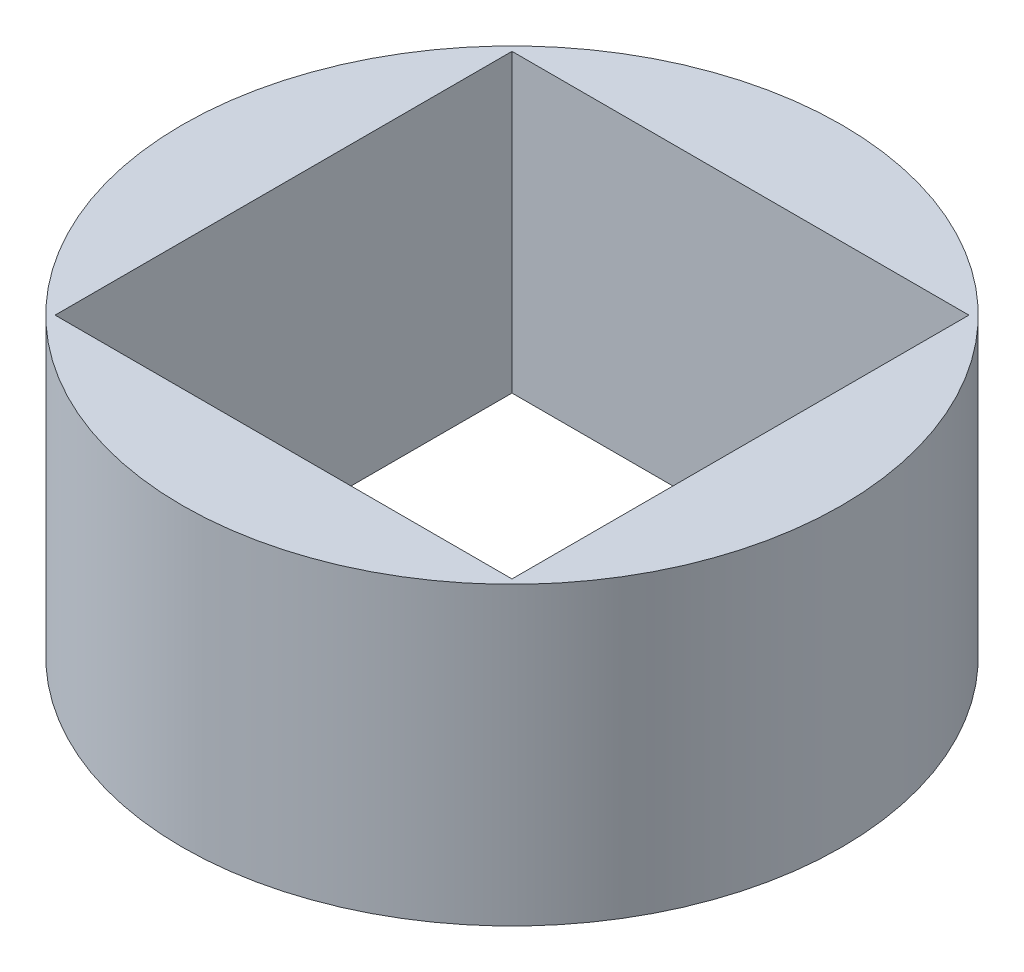
ISO-10303-21;
HEADER;
FILE_DESCRIPTION(('STEP AP214'),'2;1');
FILE_NAME('part.step','',(''),(''),'','','');
FILE_SCHEMA(('AUTOMOTIVE_DESIGN { 1 0 10303 214 1 1 1 1 }'));
ENDSEC;
DATA;
#1=APPLICATION_CONTEXT('core data for automotive mechanical design processes');
#2=APPLICATION_PROTOCOL_DEFINITION('international standard','automotive_design',2000,#1);
#3=PRODUCT_CONTEXT('',#1,'mechanical');
#4=PRODUCT('Part','Part','',(#3));
#5=PRODUCT_RELATED_PRODUCT_CATEGORY('part','',(#4));
#6=PRODUCT_DEFINITION_FORMATION('','',#4);
#7=PRODUCT_DEFINITION_CONTEXT('part definition',#1,'design');
#8=PRODUCT_DEFINITION('design','',#6,#7);
#9=PRODUCT_DEFINITION_SHAPE('','',#8);
#10=(LENGTH_UNIT() NAMED_UNIT(*) SI_UNIT(.MILLI.,.METRE.));
#11=(NAMED_UNIT(*) PLANE_ANGLE_UNIT() SI_UNIT($,.RADIAN.));
#12=(NAMED_UNIT(*) SI_UNIT($,.STERADIAN.) SOLID_ANGLE_UNIT());
#13=UNCERTAINTY_MEASURE_WITH_UNIT(LENGTH_MEASURE(1.E-05),#10,'distance_accuracy_value','');
#14=(GEOMETRIC_REPRESENTATION_CONTEXT(3) GLOBAL_UNCERTAINTY_ASSIGNED_CONTEXT((#13)) GLOBAL_UNIT_ASSIGNED_CONTEXT((#10,
#11,#12)) REPRESENTATION_CONTEXT('',''));
#15=CARTESIAN_POINT('',(0.,0.,0.));
#16=DIRECTION('',(0.,0.,1.));
#17=DIRECTION('',(1.,0.,0.));
#18=AXIS2_PLACEMENT_3D('',#15,#16,#17);
#19=CARTESIAN_POINT('',(0.,1.14,0.));
#20=DIRECTION('',(0.,-1.,0.));
#21=DIRECTION('',(0.,0.,-1.));
#22=AXIS2_PLACEMENT_3D('',#19,#20,#21);
#23=CYLINDRICAL_SURFACE('',#22,1.27);
#24=CARTESIAN_POINT('',(0.,1.14,0.));
#25=DIRECTION('',(0.,1.,0.));
#26=DIRECTION('',(0.,0.,1.));
#27=AXIS2_PLACEMENT_3D('',#24,#25,#26);
#28=CIRCLE('',#27,1.27);
#29=CARTESIAN_POINT('',(0.,1.14,1.27));
#30=VERTEX_POINT('',#29);
#31=EDGE_CURVE('E11',#30,#30,#28,.T.);
#32=ORIENTED_EDGE('',*,*,#31,.F.);
#33=EDGE_LOOP('',(#32));
#34=FACE_BOUND('',#33,.T.);
#35=CARTESIAN_POINT('',(0.,0.,0.));
#36=DIRECTION('',(0.,1.,0.));
#37=DIRECTION('',(0.,0.,1.));
#38=AXIS2_PLACEMENT_3D('',#35,#36,#37);
#39=CIRCLE('',#38,1.27);
#40=CARTESIAN_POINT('',(0.,0.,1.27));
#41=VERTEX_POINT('',#40);
#42=EDGE_CURVE('E42',#41,#41,#39,.T.);
#43=ORIENTED_EDGE('',*,*,#42,.T.);
#44=EDGE_LOOP('',(#43));
#45=FACE_BOUND('',#44,.T.);
#46=ADVANCED_FACE('F39',(#34,#45),#23,.T.);
#47=CARTESIAN_POINT('',(0.,1.14,0.));
#48=DIRECTION('',(0.,1.,0.));
#49=DIRECTION('',(0.,0.,1.));
#50=AXIS2_PLACEMENT_3D('',#47,#48,#49);
#51=PLANE('',#50);
#52=DIRECTION('',(0.,0.,-1.));
#53=VECTOR('',#52,1.);
#54=CARTESIAN_POINT('',(0.88,1.14,0.88));
#55=LINE('',#54,#53);
#56=CARTESIAN_POINT('',(0.88,1.14,0.88));
#57=VERTEX_POINT('',#56);
#58=CARTESIAN_POINT('',(0.88,1.14,-0.88));
#59=VERTEX_POINT('',#58);
#60=EDGE_CURVE('E54',#57,#59,#55,.T.);
#61=ORIENTED_EDGE('',*,*,#60,.F.);
#62=DIRECTION('',(1.,0.,0.));
#63=VECTOR('',#62,1.);
#64=CARTESIAN_POINT('',(-0.88,1.14,0.88));
#65=LINE('',#64,#63);
#66=CARTESIAN_POINT('',(-0.88,1.14,0.88));
#67=VERTEX_POINT('',#66);
#68=EDGE_CURVE('E101',#67,#57,#65,.T.);
#69=ORIENTED_EDGE('',*,*,#68,.F.);
#70=DIRECTION('',(0.,0.,1.));
#71=VECTOR('',#70,1.);
#72=CARTESIAN_POINT('',(-0.88,1.14,0.88));
#73=LINE('',#72,#71);
#74=CARTESIAN_POINT('',(-0.88,1.14,-0.88));
#75=VERTEX_POINT('',#74);
#76=EDGE_CURVE('E105',#75,#67,#73,.T.);
#77=ORIENTED_EDGE('',*,*,#76,.F.);
#78=DIRECTION('',(-1.,0.,0.));
#79=VECTOR('',#78,1.);
#80=CARTESIAN_POINT('',(-0.88,1.14,-0.88));
#81=LINE('',#80,#79);
#82=EDGE_CURVE('E114',#59,#75,#81,.T.);
#83=ORIENTED_EDGE('',*,*,#82,.F.);
#84=EDGE_LOOP('',(#61,#69,#77,#83));
#85=FACE_BOUND('',#84,.T.);
#86=ORIENTED_EDGE('',*,*,#31,.T.);
#87=EDGE_LOOP('',(#86));
#88=FACE_BOUND('',#87,.T.);
#89=ADVANCED_FACE('F131',(#85,#88),#51,.T.);
#90=CARTESIAN_POINT('',(0.,0.,0.));
#91=DIRECTION('',(0.,1.,0.));
#92=DIRECTION('',(0.,0.,1.));
#93=AXIS2_PLACEMENT_3D('',#90,#91,#92);
#94=PLANE('',#93);
#95=DIRECTION('',(1.,0.,0.));
#96=VECTOR('',#95,1.);
#97=CARTESIAN_POINT('',(-0.88,0.,0.88));
#98=LINE('',#97,#96);
#99=CARTESIAN_POINT('',(-0.88,0.,0.88));
#100=VERTEX_POINT('',#99);
#101=CARTESIAN_POINT('',(0.88,0.,0.88));
#102=VERTEX_POINT('',#101);
#103=EDGE_CURVE('E89',#100,#102,#98,.T.);
#104=ORIENTED_EDGE('',*,*,#103,.T.);
#105=DIRECTION('',(0.,0.,-1.));
#106=VECTOR('',#105,1.);
#107=CARTESIAN_POINT('',(0.88,0.,0.88));
#108=LINE('',#107,#106);
#109=CARTESIAN_POINT('',(0.88,0.,-0.88));
#110=VERTEX_POINT('',#109);
#111=EDGE_CURVE('E82',#102,#110,#108,.T.);
#112=ORIENTED_EDGE('',*,*,#111,.T.);
#113=DIRECTION('',(-1.,0.,0.));
#114=VECTOR('',#113,1.);
#115=CARTESIAN_POINT('',(-0.88,0.,-0.88));
#116=LINE('',#115,#114);
#117=CARTESIAN_POINT('',(-0.88,0.,-0.88));
#118=VERTEX_POINT('',#117);
#119=EDGE_CURVE('E92',#110,#118,#116,.T.);
#120=ORIENTED_EDGE('',*,*,#119,.T.);
#121=DIRECTION('',(0.,0.,1.));
#122=VECTOR('',#121,1.);
#123=CARTESIAN_POINT('',(-0.88,0.,0.88));
#124=LINE('',#123,#122);
#125=EDGE_CURVE('E62',#118,#100,#124,.T.);
#126=ORIENTED_EDGE('',*,*,#125,.T.);
#127=EDGE_LOOP('',(#104,#112,#120,#126));
#128=FACE_BOUND('',#127,.T.);
#129=ORIENTED_EDGE('',*,*,#42,.F.);
#130=EDGE_LOOP('',(#129));
#131=FACE_BOUND('',#130,.T.);
#132=ADVANCED_FACE('F97',(#128,#131),#94,.F.);
#133=CARTESIAN_POINT('',(0.88,0.,0.88));
#134=DIRECTION('',(1.,0.,0.));
#135=DIRECTION('',(0.,0.,-1.));
#136=AXIS2_PLACEMENT_3D('',#133,#134,#135);
#137=PLANE('',#136);
#138=ORIENTED_EDGE('',*,*,#60,.T.);
#139=DIRECTION('',(0.,1.,0.));
#140=VECTOR('',#139,1.);
#141=CARTESIAN_POINT('',(0.88,0.,-0.88));
#142=LINE('',#141,#140);
#143=EDGE_CURVE('E78',#110,#59,#142,.T.);
#144=ORIENTED_EDGE('',*,*,#143,.F.);
#145=ORIENTED_EDGE('',*,*,#111,.F.);
#146=DIRECTION('',(0.,1.,0.));
#147=VECTOR('',#146,1.);
#148=CARTESIAN_POINT('',(0.88,0.,0.88));
#149=LINE('',#148,#147);
#150=EDGE_CURVE('E120',#102,#57,#149,.T.);
#151=ORIENTED_EDGE('',*,*,#150,.T.);
#152=EDGE_LOOP('',(#138,#144,#145,#151));
#153=FACE_BOUND('',#152,.T.);
#154=ADVANCED_FACE('F80',(#153),#137,.F.);
#155=CARTESIAN_POINT('',(-0.88,0.,0.88));
#156=DIRECTION('',(0.,0.,1.));
#157=DIRECTION('',(1.,0.,0.));
#158=AXIS2_PLACEMENT_3D('',#155,#156,#157);
#159=PLANE('',#158);
#160=ORIENTED_EDGE('',*,*,#68,.T.);
#161=ORIENTED_EDGE('',*,*,#150,.F.);
#162=ORIENTED_EDGE('',*,*,#103,.F.);
#163=DIRECTION('',(0.,1.,0.));
#164=VECTOR('',#163,1.);
#165=CARTESIAN_POINT('',(-0.88,0.,0.88));
#166=LINE('',#165,#164);
#167=EDGE_CURVE('E123',#100,#67,#166,.T.);
#168=ORIENTED_EDGE('',*,*,#167,.T.);
#169=EDGE_LOOP('',(#160,#161,#162,#168));
#170=FACE_BOUND('',#169,.T.);
#171=ADVANCED_FACE('F134',(#170),#159,.F.);
#172=CARTESIAN_POINT('',(-0.88,0.,0.88));
#173=DIRECTION('',(-1.,0.,0.));
#174=DIRECTION('',(0.,0.,1.));
#175=AXIS2_PLACEMENT_3D('',#172,#173,#174);
#176=PLANE('',#175);
#177=ORIENTED_EDGE('',*,*,#76,.T.);
#178=ORIENTED_EDGE('',*,*,#167,.F.);
#179=ORIENTED_EDGE('',*,*,#125,.F.);
#180=DIRECTION('',(0.,1.,0.));
#181=VECTOR('',#180,1.);
#182=CARTESIAN_POINT('',(-0.88,0.,-0.88));
#183=LINE('',#182,#181);
#184=EDGE_CURVE('E88',#118,#75,#183,.T.);
#185=ORIENTED_EDGE('',*,*,#184,.T.);
#186=EDGE_LOOP('',(#177,#178,#179,#185));
#187=FACE_BOUND('',#186,.T.);
#188=ADVANCED_FACE('F127',(#187),#176,.F.);
#189=CARTESIAN_POINT('',(-0.88,0.,-0.88));
#190=DIRECTION('',(0.,0.,-1.));
#191=DIRECTION('',(-1.,0.,0.));
#192=AXIS2_PLACEMENT_3D('',#189,#190,#191);
#193=PLANE('',#192);
#194=ORIENTED_EDGE('',*,*,#82,.T.);
#195=ORIENTED_EDGE('',*,*,#184,.F.);
#196=ORIENTED_EDGE('',*,*,#119,.F.);
#197=ORIENTED_EDGE('',*,*,#143,.T.);
#198=EDGE_LOOP('',(#194,#195,#196,#197));
#199=FACE_BOUND('',#198,.T.);
#200=ADVANCED_FACE('F93',(#199),#193,.F.);
#201=CLOSED_SHELL('',(#46,#89,#132,#154,#171,#188,#200));
#202=MANIFOLD_SOLID_BREP('B2',#201);
#203=ADVANCED_BREP_SHAPE_REPRESENTATION('',(#18,#202),#14);
#204=SHAPE_DEFINITION_REPRESENTATION(#9,#203);
ENDSEC;
END-ISO-10303-21;
